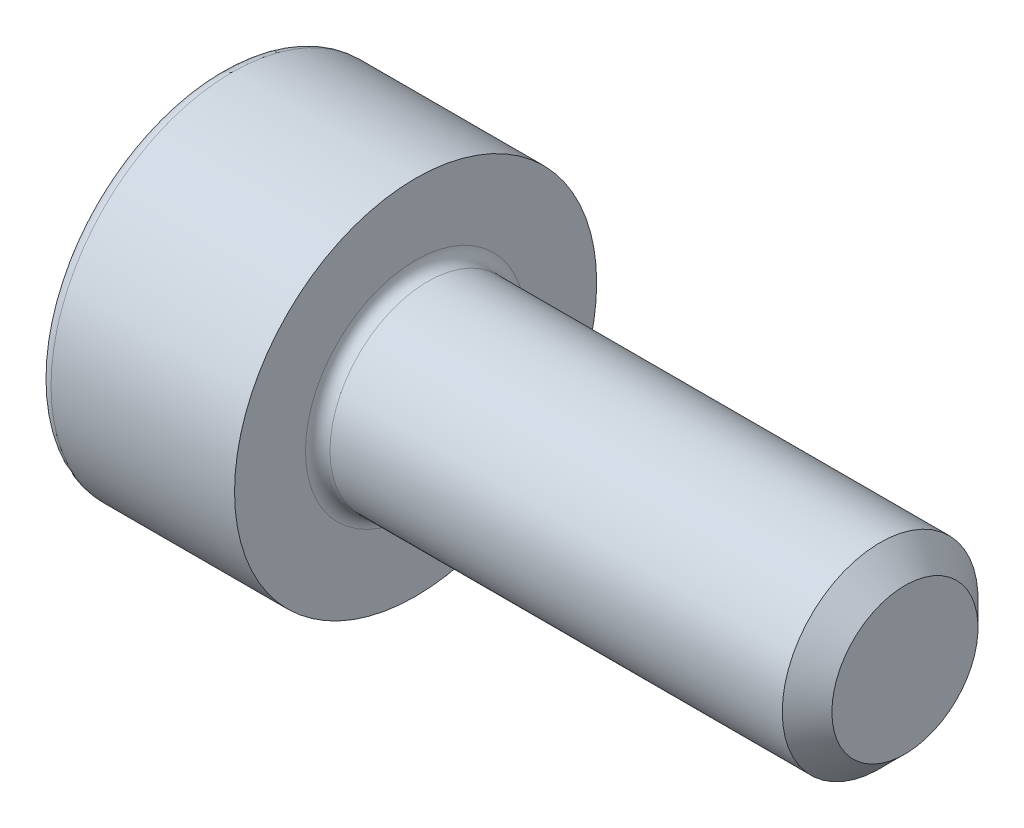
ISO-10303-21;
HEADER;
FILE_DESCRIPTION(('STEP AP214'),'2;1');
FILE_NAME('part.step','',(''),(''),'','','');
FILE_SCHEMA(('AUTOMOTIVE_DESIGN { 1 0 10303 214 1 1 1 1 }'));
ENDSEC;
DATA;
#1=APPLICATION_CONTEXT('core data for automotive mechanical design processes');
#2=APPLICATION_PROTOCOL_DEFINITION('international standard','automotive_design',2000,#1);
#3=PRODUCT_CONTEXT('',#1,'mechanical');
#4=PRODUCT('Part','Part','',(#3));
#5=PRODUCT_RELATED_PRODUCT_CATEGORY('part','',(#4));
#6=PRODUCT_DEFINITION_FORMATION('','',#4);
#7=PRODUCT_DEFINITION_CONTEXT('part definition',#1,'design');
#8=PRODUCT_DEFINITION('design','',#6,#7);
#9=PRODUCT_DEFINITION_SHAPE('','',#8);
#10=(LENGTH_UNIT() NAMED_UNIT(*) SI_UNIT(.MILLI.,.METRE.));
#11=(NAMED_UNIT(*) PLANE_ANGLE_UNIT() SI_UNIT($,.RADIAN.));
#12=(NAMED_UNIT(*) SI_UNIT($,.STERADIAN.) SOLID_ANGLE_UNIT());
#13=UNCERTAINTY_MEASURE_WITH_UNIT(LENGTH_MEASURE(1.E-05),#10,'distance_accuracy_value','');
#14=(GEOMETRIC_REPRESENTATION_CONTEXT(3) GLOBAL_UNCERTAINTY_ASSIGNED_CONTEXT((#13)) GLOBAL_UNIT_ASSIGNED_CONTEXT((#10,
#11,#12)) REPRESENTATION_CONTEXT('',''));
#15=CARTESIAN_POINT('',(0.,0.,0.));
#16=DIRECTION('',(0.,0.,1.));
#17=DIRECTION('',(1.,0.,0.));
#18=AXIS2_PLACEMENT_3D('',#15,#16,#17);
#19=CARTESIAN_POINT('',(5.,0.,0.));
#20=DIRECTION('',(-1.,0.,0.));
#21=DIRECTION('',(0.,0.,1.));
#22=AXIS2_PLACEMENT_3D('',#19,#20,#21);
#23=CONICAL_SURFACE('',#22,0.746499999993503,0.785398163397449);
#24=CARTESIAN_POINT('',(4.7464999999935,0.,0.));
#25=DIRECTION('',(-1.,0.,0.));
#26=DIRECTION('',(0.,0.,1.));
#27=AXIS2_PLACEMENT_3D('',#24,#25,#26);
#28=CIRCLE('',#27,1.);
#29=CARTESIAN_POINT('',(4.7464999999935,0.,1.));
#30=VERTEX_POINT('',#29);
#31=EDGE_CURVE('E11',#30,#30,#28,.T.);
#32=ORIENTED_EDGE('',*,*,#31,.F.);
#33=EDGE_LOOP('',(#32));
#34=FACE_BOUND('',#33,.T.);
#35=CARTESIAN_POINT('',(5.,0.,0.));
#36=DIRECTION('',(-1.,0.,0.));
#37=DIRECTION('',(0.,0.,1.));
#38=AXIS2_PLACEMENT_3D('',#35,#36,#37);
#39=CIRCLE('',#38,0.746499999993503);
#40=CARTESIAN_POINT('',(5.,0.,0.746499999993503));
#41=VERTEX_POINT('',#40);
#42=EDGE_CURVE('E134',#41,#41,#39,.T.);
#43=ORIENTED_EDGE('',*,*,#42,.T.);
#44=EDGE_LOOP('',(#43));
#45=FACE_BOUND('',#44,.T.);
#46=ADVANCED_FACE('F33',(#34,#45),#23,.T.);
#47=CARTESIAN_POINT('',(-2.,0.,0.));
#48=DIRECTION('',(-1.,0.,0.));
#49=DIRECTION('',(0.,0.,1.));
#50=AXIS2_PLACEMENT_3D('',#47,#48,#49);
#51=CYLINDRICAL_SURFACE('',#50,1.);
#52=CARTESIAN_POINT('',(0.125,0.,0.));
#53=DIRECTION('',(-1.,0.,0.));
#54=DIRECTION('',(0.,0.,1.));
#55=AXIS2_PLACEMENT_3D('',#52,#53,#54);
#56=CIRCLE('',#55,1.);
#57=CARTESIAN_POINT('',(0.125,0.,1.));
#58=VERTEX_POINT('',#57);
#59=EDGE_CURVE('E40',#58,#58,#56,.T.);
#60=ORIENTED_EDGE('',*,*,#59,.F.);
#61=EDGE_LOOP('',(#60));
#62=FACE_BOUND('',#61,.T.);
#63=ORIENTED_EDGE('',*,*,#31,.T.);
#64=EDGE_LOOP('',(#63));
#65=FACE_BOUND('',#64,.T.);
#66=ADVANCED_FACE('F158',(#62,#65),#51,.T.);
#67=CARTESIAN_POINT('',(0.125,0.,0.));
#68=DIRECTION('',(-1.,0.,0.));
#69=DIRECTION('',(0.,0.,1.));
#70=AXIS2_PLACEMENT_3D('',#67,#68,#69);
#71=TOROIDAL_SURFACE('',#70,1.125,0.125);
#72=CARTESIAN_POINT('',(0.,0.,0.));
#73=DIRECTION('',(-1.,0.,0.));
#74=DIRECTION('',(0.,0.,1.));
#75=AXIS2_PLACEMENT_3D('',#72,#73,#74);
#76=CIRCLE('',#75,1.125);
#77=CARTESIAN_POINT('',(0.,0.,1.125));
#78=VERTEX_POINT('',#77);
#79=EDGE_CURVE('E151',#78,#78,#76,.T.);
#80=ORIENTED_EDGE('',*,*,#79,.F.);
#81=EDGE_LOOP('',(#80));
#82=FACE_BOUND('',#81,.T.);
#83=ORIENTED_EDGE('',*,*,#59,.T.);
#84=EDGE_LOOP('',(#83));
#85=FACE_BOUND('',#84,.T.);
#86=ADVANCED_FACE('F156',(#82,#85),#71,.F.);
#87=CARTESIAN_POINT('',(0.,1.125,0.));
#88=DIRECTION('',(-1.,0.,0.));
#89=DIRECTION('',(0.,0.,1.));
#90=AXIS2_PLACEMENT_3D('',#87,#88,#89);
#91=PLANE('',#90);
#92=CARTESIAN_POINT('',(0.,0.,0.));
#93=DIRECTION('',(-1.,0.,0.));
#94=DIRECTION('',(0.,0.,1.));
#95=AXIS2_PLACEMENT_3D('',#92,#93,#94);
#96=CIRCLE('',#95,1.85);
#97=CARTESIAN_POINT('',(0.,0.,1.85));
#98=VERTEX_POINT('',#97);
#99=EDGE_CURVE('E148',#98,#98,#96,.T.);
#100=ORIENTED_EDGE('',*,*,#99,.F.);
#101=EDGE_LOOP('',(#100));
#102=FACE_BOUND('',#101,.T.);
#103=ORIENTED_EDGE('',*,*,#79,.T.);
#104=EDGE_LOOP('',(#103));
#105=FACE_BOUND('',#104,.T.);
#106=ADVANCED_FACE('F189',(#102,#105),#91,.F.);
#107=CARTESIAN_POINT('',(-2.,0.,0.));
#108=DIRECTION('',(-1.,0.,0.));
#109=DIRECTION('',(0.,0.,1.));
#110=AXIS2_PLACEMENT_3D('',#107,#108,#109);
#111=CYLINDRICAL_SURFACE('',#110,1.85);
#112=CARTESIAN_POINT('',(-1.875,0.,0.));
#113=DIRECTION('',(-1.,0.,0.));
#114=DIRECTION('',(0.,0.,1.));
#115=AXIS2_PLACEMENT_3D('',#112,#113,#114);
#116=CIRCLE('',#115,1.85);
#117=CARTESIAN_POINT('',(-1.875,0.,1.85));
#118=VERTEX_POINT('',#117);
#119=EDGE_CURVE('E145',#118,#118,#116,.T.);
#120=ORIENTED_EDGE('',*,*,#119,.F.);
#121=EDGE_LOOP('',(#120));
#122=FACE_BOUND('',#121,.T.);
#123=ORIENTED_EDGE('',*,*,#99,.T.);
#124=EDGE_LOOP('',(#123));
#125=FACE_BOUND('',#124,.T.);
#126=ADVANCED_FACE('F185',(#122,#125),#111,.T.);
#127=CARTESIAN_POINT('',(-1.875,0.,0.));
#128=DIRECTION('',(-1.,0.,0.));
#129=DIRECTION('',(0.,0.,1.));
#130=AXIS2_PLACEMENT_3D('',#127,#128,#129);
#131=TOROIDAL_SURFACE('',#130,1.725,0.125);
#132=CARTESIAN_POINT('',(-2.,0.,0.));
#133=DIRECTION('',(-1.,0.,0.));
#134=DIRECTION('',(0.,0.,1.));
#135=AXIS2_PLACEMENT_3D('',#132,#133,#134);
#136=CIRCLE('',#135,1.725);
#137=CARTESIAN_POINT('',(-2.,0.,1.725));
#138=VERTEX_POINT('',#137);
#139=EDGE_CURVE('E142',#138,#138,#136,.T.);
#140=ORIENTED_EDGE('',*,*,#139,.F.);
#141=EDGE_LOOP('',(#140));
#142=FACE_BOUND('',#141,.T.);
#143=ORIENTED_EDGE('',*,*,#119,.T.);
#144=EDGE_LOOP('',(#143));
#145=FACE_BOUND('',#144,.T.);
#146=ADVANCED_FACE('F178',(#142,#145),#131,.T.);
#147=CARTESIAN_POINT('',(-2.,1.725,0.));
#148=DIRECTION('',(1.,0.,0.));
#149=DIRECTION('',(0.,0.,-1.));
#150=AXIS2_PLACEMENT_3D('',#147,#148,#149);
#151=PLANE('',#150);
#152=DIRECTION('',(0.,0.5,-0.866025403784438));
#153=VECTOR('',#152,1.);
#154=CARTESIAN_POINT('',(-2.,0.433012701892219,0.75));
#155=LINE('',#154,#153);
#156=CARTESIAN_POINT('',(-2.,0.433012701892219,0.75));
#157=VERTEX_POINT('',#156);
#158=CARTESIAN_POINT('',(-2.,0.866025403784439,0.));
#159=VERTEX_POINT('',#158);
#160=EDGE_CURVE('E121',#157,#159,#155,.T.);
#161=ORIENTED_EDGE('',*,*,#160,.F.);
#162=DIRECTION('',(0.,1.,0.));
#163=VECTOR('',#162,1.);
#164=CARTESIAN_POINT('',(-2.,-0.43301270189222,0.75));
#165=LINE('',#164,#163);
#166=CARTESIAN_POINT('',(-2.,-0.43301270189222,0.75));
#167=VERTEX_POINT('',#166);
#168=EDGE_CURVE('E47',#167,#157,#165,.T.);
#169=ORIENTED_EDGE('',*,*,#168,.F.);
#170=DIRECTION('',(0.,0.5,0.866025403784439));
#171=VECTOR('',#170,1.);
#172=CARTESIAN_POINT('',(-2.,-0.866025403784439,0.));
#173=LINE('',#172,#171);
#174=CARTESIAN_POINT('',(-2.,-0.866025403784439,0.));
#175=VERTEX_POINT('',#174);
#176=EDGE_CURVE('E130',#175,#167,#173,.T.);
#177=ORIENTED_EDGE('',*,*,#176,.F.);
#178=DIRECTION('',(0.,-0.5,0.866025403784439));
#179=VECTOR('',#178,1.);
#180=CARTESIAN_POINT('',(-2.,-0.433012701892219,-0.75));
#181=LINE('',#180,#179);
#182=CARTESIAN_POINT('',(-2.,-0.433012701892219,-0.75));
#183=VERTEX_POINT('',#182);
#184=EDGE_CURVE('E128',#183,#175,#181,.T.);
#185=ORIENTED_EDGE('',*,*,#184,.F.);
#186=DIRECTION('',(0.,-1.,0.));
#187=VECTOR('',#186,1.);
#188=CARTESIAN_POINT('',(-2.,0.43301270189222,-0.75));
#189=LINE('',#188,#187);
#190=CARTESIAN_POINT('',(-2.,0.43301270189222,-0.75));
#191=VERTEX_POINT('',#190);
#192=EDGE_CURVE('E95',#191,#183,#189,.T.);
#193=ORIENTED_EDGE('',*,*,#192,.F.);
#194=DIRECTION('',(0.,-0.5,-0.866025403784439));
#195=VECTOR('',#194,1.);
#196=CARTESIAN_POINT('',(-2.,0.866025403784439,0.));
#197=LINE('',#196,#195);
#198=EDGE_CURVE('E124',#159,#191,#197,.T.);
#199=ORIENTED_EDGE('',*,*,#198,.F.);
#200=EDGE_LOOP('',(#161,#169,#177,#185,#193,#199));
#201=FACE_BOUND('',#200,.T.);
#202=ORIENTED_EDGE('',*,*,#139,.T.);
#203=EDGE_LOOP('',(#202));
#204=FACE_BOUND('',#203,.T.);
#205=ADVANCED_FACE('F170',(#201,#204),#151,.F.);
#206=CARTESIAN_POINT('',(5.,0.746499999993503,0.));
#207=DIRECTION('',(-1.,0.,0.));
#208=DIRECTION('',(0.,0.,1.));
#209=AXIS2_PLACEMENT_3D('',#206,#207,#208);
#210=PLANE('',#209);
#211=ORIENTED_EDGE('',*,*,#42,.F.);
#212=EDGE_LOOP('',(#211));
#213=FACE_BOUND('',#212,.T.);
#214=ADVANCED_FACE('F167',(#213),#210,.F.);
#215=CARTESIAN_POINT('',(-0.9,-0.43301270189222,0.75));
#216=DIRECTION('',(0.,0.,1.));
#217=DIRECTION('',(1.,0.,0.));
#218=AXIS2_PLACEMENT_3D('',#215,#216,#217);
#219=PLANE('',#218);
#220=ORIENTED_EDGE('',*,*,#168,.T.);
#221=DIRECTION('',(-1.,0.,0.));
#222=VECTOR('',#221,1.);
#223=CARTESIAN_POINT('',(-0.9,0.433012701892219,0.75));
#224=LINE('',#223,#222);
#225=CARTESIAN_POINT('',(-0.9,0.433012701892219,0.75));
#226=VERTEX_POINT('',#225);
#227=EDGE_CURVE('E77',#226,#157,#224,.T.);
#228=ORIENTED_EDGE('',*,*,#227,.F.);
#229=DIRECTION('',(0.,1.,0.));
#230=VECTOR('',#229,1.);
#231=CARTESIAN_POINT('',(-0.9,-0.43301270189222,0.75));
#232=LINE('',#231,#230);
#233=CARTESIAN_POINT('',(-0.9,-0.43301270189222,0.75));
#234=VERTEX_POINT('',#233);
#235=EDGE_CURVE('E132',#234,#226,#232,.T.);
#236=ORIENTED_EDGE('',*,*,#235,.F.);
#237=DIRECTION('',(-1.,0.,0.));
#238=VECTOR('',#237,1.);
#239=CARTESIAN_POINT('',(-0.9,-0.43301270189222,0.75));
#240=LINE('',#239,#238);
#241=EDGE_CURVE('E55',#234,#167,#240,.T.);
#242=ORIENTED_EDGE('',*,*,#241,.T.);
#243=EDGE_LOOP('',(#220,#228,#236,#242));
#244=FACE_BOUND('',#243,.T.);
#245=ADVANCED_FACE('F169',(#244),#219,.F.);
#246=CARTESIAN_POINT('',(-0.9,-0.866025403784439,0.));
#247=DIRECTION('',(0.,-0.866025403784439,0.5));
#248=DIRECTION('',(0.,-0.5,-0.866025403784439));
#249=AXIS2_PLACEMENT_3D('',#246,#247,#248);
#250=PLANE('',#249);
#251=ORIENTED_EDGE('',*,*,#176,.T.);
#252=ORIENTED_EDGE('',*,*,#241,.F.);
#253=DIRECTION('',(0.,0.5,0.866025403784439));
#254=VECTOR('',#253,1.);
#255=CARTESIAN_POINT('',(-0.9,-0.866025403784439,0.));
#256=LINE('',#255,#254);
#257=CARTESIAN_POINT('',(-0.9,-0.866025403784439,0.));
#258=VERTEX_POINT('',#257);
#259=EDGE_CURVE('E107',#258,#234,#256,.T.);
#260=ORIENTED_EDGE('',*,*,#259,.F.);
#261=DIRECTION('',(-1.,0.,0.));
#262=VECTOR('',#261,1.);
#263=CARTESIAN_POINT('',(-0.9,-0.866025403784439,0.));
#264=LINE('',#263,#262);
#265=EDGE_CURVE('E99',#258,#175,#264,.T.);
#266=ORIENTED_EDGE('',*,*,#265,.T.);
#267=EDGE_LOOP('',(#251,#252,#260,#266));
#268=FACE_BOUND('',#267,.T.);
#269=ADVANCED_FACE('F176',(#268),#250,.F.);
#270=CARTESIAN_POINT('',(-0.9,-0.433012701892219,-0.75));
#271=DIRECTION('',(0.,-0.866025403784439,-0.5));
#272=DIRECTION('',(0.,0.5,-0.866025403784439));
#273=AXIS2_PLACEMENT_3D('',#270,#271,#272);
#274=PLANE('',#273);
#275=ORIENTED_EDGE('',*,*,#184,.T.);
#276=ORIENTED_EDGE('',*,*,#265,.F.);
#277=DIRECTION('',(0.,-0.5,0.866025403784439));
#278=VECTOR('',#277,1.);
#279=CARTESIAN_POINT('',(-0.9,-0.433012701892219,-0.75));
#280=LINE('',#279,#278);
#281=CARTESIAN_POINT('',(-0.9,-0.433012701892219,-0.75));
#282=VERTEX_POINT('',#281);
#283=EDGE_CURVE('E103',#282,#258,#280,.T.);
#284=ORIENTED_EDGE('',*,*,#283,.F.);
#285=DIRECTION('',(-1.,0.,0.));
#286=VECTOR('',#285,1.);
#287=CARTESIAN_POINT('',(-0.9,-0.433012701892219,-0.75));
#288=LINE('',#287,#286);
#289=EDGE_CURVE('E88',#282,#183,#288,.T.);
#290=ORIENTED_EDGE('',*,*,#289,.T.);
#291=EDGE_LOOP('',(#275,#276,#284,#290));
#292=FACE_BOUND('',#291,.T.);
#293=ADVANCED_FACE('F104',(#292),#274,.F.);
#294=CARTESIAN_POINT('',(-0.9,0.43301270189222,-0.75));
#295=DIRECTION('',(0.,0.,-1.));
#296=DIRECTION('',(0.,1.,0.));
#297=AXIS2_PLACEMENT_3D('',#294,#295,#296);
#298=PLANE('',#297);
#299=ORIENTED_EDGE('',*,*,#192,.T.);
#300=ORIENTED_EDGE('',*,*,#289,.F.);
#301=DIRECTION('',(0.,-1.,0.));
#302=VECTOR('',#301,1.);
#303=CARTESIAN_POINT('',(-0.9,0.43301270189222,-0.75));
#304=LINE('',#303,#302);
#305=CARTESIAN_POINT('',(-0.9,0.43301270189222,-0.75));
#306=VERTEX_POINT('',#305);
#307=EDGE_CURVE('E92',#306,#282,#304,.T.);
#308=ORIENTED_EDGE('',*,*,#307,.F.);
#309=DIRECTION('',(-1.,0.,0.));
#310=VECTOR('',#309,1.);
#311=CARTESIAN_POINT('',(-0.9,0.43301270189222,-0.75));
#312=LINE('',#311,#310);
#313=EDGE_CURVE('E100',#306,#191,#312,.T.);
#314=ORIENTED_EDGE('',*,*,#313,.T.);
#315=EDGE_LOOP('',(#299,#300,#308,#314));
#316=FACE_BOUND('',#315,.T.);
#317=ADVANCED_FACE('F90',(#316),#298,.F.);
#318=CARTESIAN_POINT('',(-0.9,0.866025403784439,0.));
#319=DIRECTION('',(0.,0.866025403784439,-0.5));
#320=DIRECTION('',(0.,0.5,0.866025403784439));
#321=AXIS2_PLACEMENT_3D('',#318,#319,#320);
#322=PLANE('',#321);
#323=ORIENTED_EDGE('',*,*,#198,.T.);
#324=ORIENTED_EDGE('',*,*,#313,.F.);
#325=DIRECTION('',(0.,-0.5,-0.866025403784439));
#326=VECTOR('',#325,1.);
#327=CARTESIAN_POINT('',(-0.9,0.866025403784439,0.));
#328=LINE('',#327,#326);
#329=CARTESIAN_POINT('',(-0.9,0.866025403784439,0.));
#330=VERTEX_POINT('',#329);
#331=EDGE_CURVE('E113',#330,#306,#328,.T.);
#332=ORIENTED_EDGE('',*,*,#331,.F.);
#333=DIRECTION('',(-1.,0.,0.));
#334=VECTOR('',#333,1.);
#335=CARTESIAN_POINT('',(-0.9,0.866025403784439,0.));
#336=LINE('',#335,#334);
#337=EDGE_CURVE('E137',#330,#159,#336,.T.);
#338=ORIENTED_EDGE('',*,*,#337,.T.);
#339=EDGE_LOOP('',(#323,#324,#332,#338));
#340=FACE_BOUND('',#339,.T.);
#341=ADVANCED_FACE('F251',(#340),#322,.F.);
#342=CARTESIAN_POINT('',(-0.9,0.433012701892219,0.75));
#343=DIRECTION('',(0.,0.866025403784439,0.5));
#344=DIRECTION('',(0.,-0.5,0.866025403784438));
#345=AXIS2_PLACEMENT_3D('',#342,#343,#344);
#346=PLANE('',#345);
#347=ORIENTED_EDGE('',*,*,#160,.T.);
#348=ORIENTED_EDGE('',*,*,#337,.F.);
#349=DIRECTION('',(0.,0.5,-0.866025403784438));
#350=VECTOR('',#349,1.);
#351=CARTESIAN_POINT('',(-0.9,0.433012701892219,0.75));
#352=LINE('',#351,#350);
#353=EDGE_CURVE('E115',#226,#330,#352,.T.);
#354=ORIENTED_EDGE('',*,*,#353,.F.);
#355=ORIENTED_EDGE('',*,*,#227,.T.);
#356=EDGE_LOOP('',(#347,#348,#354,#355));
#357=FACE_BOUND('',#356,.T.);
#358=ADVANCED_FACE('F260',(#357),#346,.F.);
#359=CARTESIAN_POINT('',(-0.9,0.,0.));
#360=DIRECTION('',(-1.,0.,0.));
#361=DIRECTION('',(0.,0.,1.));
#362=AXIS2_PLACEMENT_3D('',#359,#360,#361);
#363=PLANE('',#362);
#364=ORIENTED_EDGE('',*,*,#235,.T.);
#365=ORIENTED_EDGE('',*,*,#353,.T.);
#366=ORIENTED_EDGE('',*,*,#331,.T.);
#367=ORIENTED_EDGE('',*,*,#307,.T.);
#368=ORIENTED_EDGE('',*,*,#283,.T.);
#369=ORIENTED_EDGE('',*,*,#259,.T.);
#370=EDGE_LOOP('',(#364,#365,#366,#367,#368,#369));
#371=FACE_BOUND('',#370,.T.);
#372=ADVANCED_FACE('F110',(#371),#363,.T.);
#373=CLOSED_SHELL('',(#46,#66,#86,#106,#126,#146,#205,#214,#245,#269,#293,#317,#341,#358,#372));
#374=MANIFOLD_SOLID_BREP('B2',#373);
#375=ADVANCED_BREP_SHAPE_REPRESENTATION('',(#18,#374),#14);
#376=SHAPE_DEFINITION_REPRESENTATION(#9,#375);
ENDSEC;
END-ISO-10303-21;
